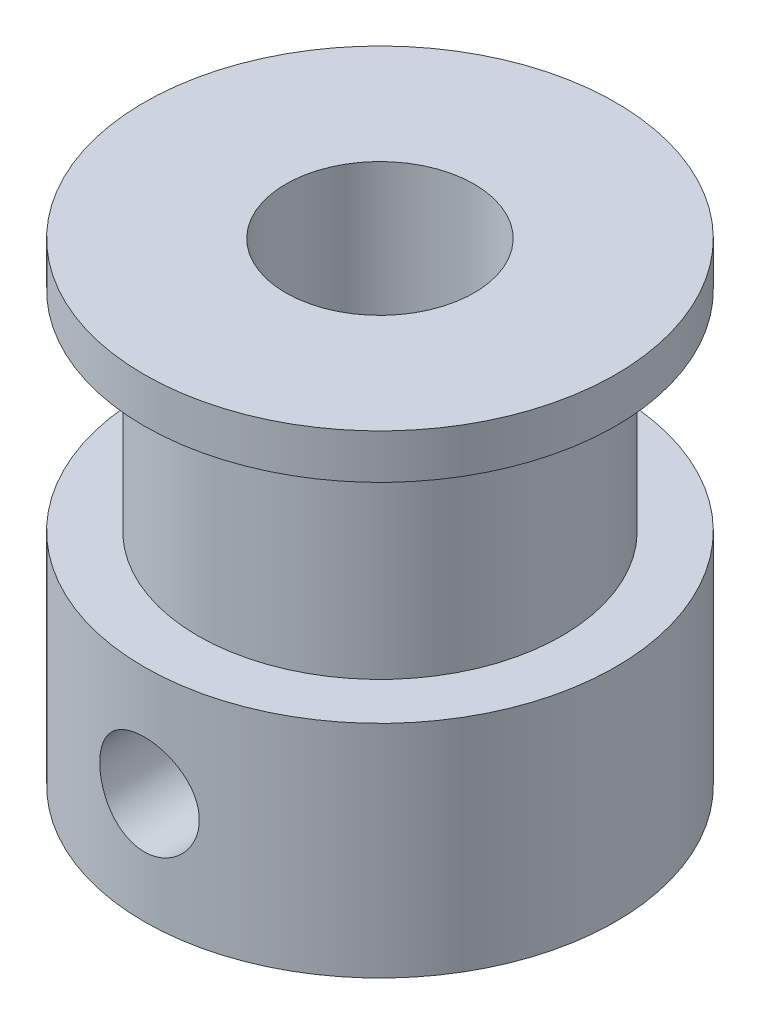
ISO-10303-21;
HEADER;
FILE_DESCRIPTION(('STEP AP214'),'2;1');
FILE_NAME('part.step','',(''),(''),'','','');
FILE_SCHEMA(('AUTOMOTIVE_DESIGN { 1 0 10303 214 1 1 1 1 }'));
ENDSEC;
DATA;
#1=APPLICATION_CONTEXT('core data for automotive mechanical design processes');
#2=APPLICATION_PROTOCOL_DEFINITION('international standard','automotive_design',2000,#1);
#3=PRODUCT_CONTEXT('',#1,'mechanical');
#4=PRODUCT('Part','Part','',(#3));
#5=PRODUCT_RELATED_PRODUCT_CATEGORY('part','',(#4));
#6=PRODUCT_DEFINITION_FORMATION('','',#4);
#7=PRODUCT_DEFINITION_CONTEXT('part definition',#1,'design');
#8=PRODUCT_DEFINITION('design','',#6,#7);
#9=PRODUCT_DEFINITION_SHAPE('','',#8);
#10=(LENGTH_UNIT() NAMED_UNIT(*) SI_UNIT(.MILLI.,.METRE.));
#11=(NAMED_UNIT(*) PLANE_ANGLE_UNIT() SI_UNIT($,.RADIAN.));
#12=(NAMED_UNIT(*) SI_UNIT($,.STERADIAN.) SOLID_ANGLE_UNIT());
#13=UNCERTAINTY_MEASURE_WITH_UNIT(LENGTH_MEASURE(1.E-05),#10,'distance_accuracy_value','');
#14=(GEOMETRIC_REPRESENTATION_CONTEXT(3) GLOBAL_UNCERTAINTY_ASSIGNED_CONTEXT((#13)) GLOBAL_UNIT_ASSIGNED_CONTEXT((#10,
#11,#12)) REPRESENTATION_CONTEXT('',''));
#15=CARTESIAN_POINT('',(0.,0.,0.));
#16=DIRECTION('',(0.,0.,1.));
#17=DIRECTION('',(1.,0.,0.));
#18=AXIS2_PLACEMENT_3D('',#15,#16,#17);
#19=CARTESIAN_POINT('',(0.,7.42,0.));
#20=DIRECTION('',(0.,1.,0.));
#21=DIRECTION('',(0.,0.,1.));
#22=AXIS2_PLACEMENT_3D('',#19,#20,#21);
#23=PLANE('',#22);
#24=CARTESIAN_POINT('',(0.,7.42,0.));
#25=DIRECTION('',(0.,1.,0.));
#26=DIRECTION('',(0.,0.,1.));
#27=AXIS2_PLACEMENT_3D('',#24,#25,#26);
#28=CIRCLE('',#27,6.12);
#29=CARTESIAN_POINT('',(0.,7.42,6.12));
#30=VERTEX_POINT('',#29);
#31=EDGE_CURVE('E11',#30,#30,#28,.T.);
#32=ORIENTED_EDGE('',*,*,#31,.F.);
#33=EDGE_LOOP('',(#32));
#34=FACE_BOUND('',#33,.T.);
#35=CARTESIAN_POINT('',(0.,7.42,0.));
#36=DIRECTION('',(0.,1.,0.));
#37=DIRECTION('',(0.,0.,1.));
#38=AXIS2_PLACEMENT_3D('',#35,#36,#37);
#39=CIRCLE('',#38,7.92999999999999);
#40=CARTESIAN_POINT('',(0.,7.42,7.92999999999999));
#41=VERTEX_POINT('',#40);
#42=EDGE_CURVE('E52',#41,#41,#39,.T.);
#43=ORIENTED_EDGE('',*,*,#42,.T.);
#44=EDGE_LOOP('',(#43));
#45=FACE_BOUND('',#44,.T.);
#46=ADVANCED_FACE('F38',(#34,#45),#23,.T.);
#47=CARTESIAN_POINT('',(0.,0.,0.));
#48=DIRECTION('',(0.,1.,0.));
#49=DIRECTION('',(0.,0.,1.));
#50=AXIS2_PLACEMENT_3D('',#47,#48,#49);
#51=PLANE('',#50);
#52=CARTESIAN_POINT('',(0.,0.,0.));
#53=DIRECTION('',(0.,1.,0.));
#54=DIRECTION('',(0.,0.,1.));
#55=AXIS2_PLACEMENT_3D('',#52,#53,#54);
#56=CIRCLE('',#55,7.92999999999999);
#57=CARTESIAN_POINT('',(0.,0.,7.92999999999999));
#58=VERTEX_POINT('',#57);
#59=EDGE_CURVE('E57',#58,#58,#56,.T.);
#60=ORIENTED_EDGE('',*,*,#59,.F.);
#61=EDGE_LOOP('',(#60));
#62=FACE_BOUND('',#61,.T.);
#63=CARTESIAN_POINT('',(0.,0.,0.));
#64=DIRECTION('',(0.,1.,0.));
#65=DIRECTION('',(0.,0.,1.));
#66=AXIS2_PLACEMENT_3D('',#63,#64,#65);
#67=CIRCLE('',#66,3.17000000000001);
#68=CARTESIAN_POINT('',(0.,0.,3.17000000000001));
#69=VERTEX_POINT('',#68);
#70=EDGE_CURVE('E63',#69,#69,#67,.T.);
#71=ORIENTED_EDGE('',*,*,#70,.T.);
#72=EDGE_LOOP('',(#71));
#73=FACE_BOUND('',#72,.T.);
#74=ADVANCED_FACE('F69',(#62,#73),#51,.F.);
#75=CARTESIAN_POINT('',(0.,7.42,0.));
#76=DIRECTION('',(0.,-1.,0.));
#77=DIRECTION('',(0.,0.,-1.));
#78=AXIS2_PLACEMENT_3D('',#75,#76,#77);
#79=CYLINDRICAL_SURFACE('',#78,7.92999999999999);
#80=CARTESIAN_POINT('',(0.,2.035,7.92999999999999));
#81=CARTESIAN_POINT('',(-0.0929785195609703,2.03500328079509,7.92999827888013));
#82=CARTESIAN_POINT('',(-0.185997419259813,2.0427679426953,7.92834806738624));
#83=CARTESIAN_POINT('',(-0.369398343951281,2.07359231272858,7.92192434589284));
#84=CARTESIAN_POINT('',(-0.45977834543358,2.09666345216657,7.91714850161958));
#85=CARTESIAN_POINT('',(-0.635223966545834,2.1573501378775,7.90500590091723));
#86=CARTESIAN_POINT('',(-0.720294848863207,2.19495100670619,7.89764175977538));
#87=CARTESIAN_POINT('',(-0.882916349447481,2.28358441702819,7.88111972055548));
#88=CARTESIAN_POINT('',(-0.960467265308537,2.33461642670223,7.87196189350387));
#89=CARTESIAN_POINT('',(-1.10701653373238,2.44947532831164,7.85270382389809));
#90=CARTESIAN_POINT('',(-1.17588571161493,2.51346520149115,7.84259255510153));
#91=CARTESIAN_POINT('',(-1.30199712959213,2.65207330506615,7.82264592476207));
#92=CARTESIAN_POINT('',(-1.35923838751393,2.72669243237554,7.81281058658656));
#93=CARTESIAN_POINT('',(-1.46103076880605,2.88538534262308,7.79442114612899));
#94=CARTESIAN_POINT('',(-1.5054459194911,2.96954813030429,7.78588119752874));
#95=CARTESIAN_POINT('',(-1.57945356651655,3.144352653784,7.77120706386982));
#96=CARTESIAN_POINT('',(-1.60904770745094,3.23499366945837,7.76507261190476));
#97=CARTESIAN_POINT('',(-1.65214944714117,3.41878505753669,7.75601604452723));
#98=CARTESIAN_POINT('',(-1.66588491558434,3.51187970429349,7.75304847322218));
#99=CARTESIAN_POINT('',(-1.67758763937562,3.69909571655325,7.75052502797822));
#100=CARTESIAN_POINT('',(-1.6755566980792,3.79321696340439,7.75096876385534));
#101=CARTESIAN_POINT('',(-1.6559679816574,3.97813151638685,7.75517658258885));
#102=CARTESIAN_POINT('',(-1.63867347277293,4.06895418537422,7.75888436438763));
#103=CARTESIAN_POINT('',(-1.58946501005289,4.24637923623298,7.76911363764519));
#104=CARTESIAN_POINT('',(-1.55755028585949,4.33298139545425,7.77563527736869));
#105=CARTESIAN_POINT('',(-1.47976165619798,4.50025483821633,7.79081377601787));
#106=CARTESIAN_POINT('',(-1.43378524385488,4.5808769788526,7.79948622303128));
#107=CARTESIAN_POINT('',(-1.32925051635568,4.73335990928457,7.81797942891874));
#108=CARTESIAN_POINT('',(-1.27069059612902,4.8052195795619,7.82780033420975));
#109=CARTESIAN_POINT('',(-1.14125099198299,4.93965486455684,7.84772642201304));
#110=CARTESIAN_POINT('',(-1.07014709713321,5.00201454147165,7.85783334805819));
#111=CARTESIAN_POINT('',(-0.918378148910625,5.11395788899735,7.87701229299846));
#112=CARTESIAN_POINT('',(-0.837712944271661,5.16354135744088,7.88608429551596));
#113=CARTESIAN_POINT('',(-0.668857349893165,5.24857260667174,7.90219762304859));
#114=CARTESIAN_POINT('',(-0.580653068089339,5.28399357797838,7.90923508979979));
#115=CARTESIAN_POINT('',(-0.399363319651179,5.33945267262922,7.92045751251892));
#116=CARTESIAN_POINT('',(-0.306278515779156,5.35949287889137,7.92464285472309));
#117=CARTESIAN_POINT('',(-0.119723690143854,5.38331093715938,7.92963496486762));
#118=CARTESIAN_POINT('',(-0.0262929491256835,5.38738398107678,7.93050305264236));
#119=CARTESIAN_POINT('',(0.159913935145314,5.37995009729393,7.92893405692231));
#120=CARTESIAN_POINT('',(0.252690119284892,5.36844415155001,7.92649718174199));
#121=CARTESIAN_POINT('',(0.433986826800555,5.33042388864374,7.91863063370873));
#122=CARTESIAN_POINT('',(0.522540975889206,5.30406301981403,7.91323157443235));
#123=CARTESIAN_POINT('',(0.693971384501054,5.23725043405823,7.90004442011031));
#124=CARTESIAN_POINT('',(0.776847182733767,5.19679757396559,7.89225613125238));
#125=CARTESIAN_POINT('',(0.935798994223132,5.10232461982279,7.87500248942195));
#126=CARTESIAN_POINT('',(1.01176853912059,5.04812933850005,7.86551598580049));
#127=CARTESIAN_POINT('',(1.15364093877458,4.92794221635097,7.84596395077763));
#128=CARTESIAN_POINT('',(1.21954257850674,4.86194895379196,7.83589834969053));
#129=CARTESIAN_POINT('',(1.34056419387628,4.71868886632637,7.81611285332782));
#130=CARTESIAN_POINT('',(1.39548045953024,4.64124850994498,7.80640181678013));
#131=CARTESIAN_POINT('',(1.49152782471683,4.47806993190348,7.78862249141513));
#132=CARTESIAN_POINT('',(1.53265950510428,4.39233206008032,7.78055413338428));
#133=CARTESIAN_POINT('',(1.59970241014937,4.2154428017032,7.76704725007528));
#134=CARTESIAN_POINT('',(1.62569681688632,4.12432409053801,7.76159438196496));
#135=CARTESIAN_POINT('',(1.66197477563768,3.93888310824507,7.7539080439279));
#136=CARTESIAN_POINT('',(1.67226064676589,3.84456131210377,7.75167409878148));
#137=CARTESIAN_POINT('',(1.67673608330772,3.65744187468164,7.75070703997789));
#138=CARTESIAN_POINT('',(1.67124816640621,3.56465216232954,7.75190377972705));
#139=CARTESIAN_POINT('',(1.64504903919186,3.38135116663489,7.7575053923616));
#140=CARTESIAN_POINT('',(1.62433798384298,3.29083986010902,7.76191023259013));
#141=CARTESIAN_POINT('',(1.56843148636623,3.1149002237667,7.77339868493138));
#142=CARTESIAN_POINT('',(1.53327995492345,3.02945737539809,7.78047417087825));
#143=CARTESIAN_POINT('',(1.44952922579225,2.86563299060743,7.79651043460839));
#144=CARTESIAN_POINT('',(1.40092873745623,2.78725213285646,7.80547139331384));
#145=CARTESIAN_POINT('',(1.29057688423831,2.63818012077453,7.82448056626243));
#146=CARTESIAN_POINT('',(1.22859439452383,2.56766223798156,7.83454612431419));
#147=CARTESIAN_POINT('',(1.09371008609985,2.43792232559419,7.85451063175016));
#148=CARTESIAN_POINT('',(1.02080575457955,2.37870290260699,7.86440954220889));
#149=CARTESIAN_POINT('',(0.86510097098892,2.27256867264387,7.88306506585043));
#150=CARTESIAN_POINT('',(0.782192912906183,2.22580895595808,7.89180665584748));
#151=CARTESIAN_POINT('',(0.609529884101386,2.14696153543418,7.90701316428416));
#152=CARTESIAN_POINT('',(0.519780912016576,2.11486114602011,7.91348005004096));
#153=CARTESIAN_POINT('',(0.358245615745182,2.07216964208584,7.92221227215797));
#154=CARTESIAN_POINT('',(0.287352762826745,2.05825689393976,7.92511499560546));
#155=CARTESIAN_POINT('',(0.144314683473388,2.0396709792332,7.92900949034278));
#156=CARTESIAN_POINT('',(0.0721695058375225,2.03499745346171,7.93000133592544));
#157=CARTESIAN_POINT('',(0.,2.035,7.92999999999999));
#158=B_SPLINE_CURVE_WITH_KNOTS('',3,(#80,#81,#82,#83,#84,#85,#86,#87,#88,#89,#90,#91,#92,#93,
#94,#95,#96,#97,#98,#99,#100,#101,#102,#103,#104,#105,#106,#107,#108,#109,#110,#111,#112,#113,
#114,#115,#116,#117,#118,#119,#120,#121,#122,#123,#124,#125,#126,#127,#128,#129,#130,#131,#132,
#133,#134,#135,#136,#137,#138,#139,#140,#141,#142,#143,#144,#145,#146,#147,#148,#149,#150,#151,
#152,#153,#154,#155,#156,#157),.UNSPECIFIED.,.T.,.F.,(4,2,2,2,2,2,2,2,2,2,2,2,2,2,2,2,2,2,2,2,2,
2,2,2,2,2,2,2,2,2,2,2,2,2,2,2,2,2,4),(0.,0.278671452541108,0.557551259334921,0.836150084481277,
1.11473787989128,1.3970756543555,1.67943726707259,1.96469074190857,2.2499125569484,
2.530982977346,2.812021249498,3.08830488061134,3.36460307113683,3.64296546861559,
3.92136339329274,4.20536389090204,4.48936888218441,4.77390897557075,5.05841052872255,
5.33762685746145,5.61682558778865,5.89319177004584,6.16958037682554,6.44968698620969,
6.72982737302403,7.01475973414001,7.29968008726688,7.58301960507788,7.8663172883,
8.14386400355453,8.42140789356096,8.69811400103385,8.97484667220265,9.25680797279111,
9.53883424471114,9.82422237244761,10.1093630669253,10.3256749965865,10.5419785161077),.UNSPECIFIED.);
#159=CARTESIAN_POINT('',(0.,2.035,7.92999999999999));
#160=VERTEX_POINT('',#159);
#161=EDGE_CURVE('E128',#160,#160,#158,.T.);
#162=ORIENTED_EDGE('',*,*,#161,.T.);
#163=EDGE_LOOP('',(#162));
#164=FACE_BOUND('',#163,.T.);
#165=CARTESIAN_POINT('',(-7.92999999999999,2.035,0.));
#166=CARTESIAN_POINT('',(-7.92999827888013,2.03500328079509,-0.092978519560998));
#167=CARTESIAN_POINT('',(-7.92834806738624,2.0427679426953,-0.185997419259841));
#168=CARTESIAN_POINT('',(-7.92192434589284,2.07359231272858,-0.369398343951309));
#169=CARTESIAN_POINT('',(-7.91714850161958,2.09666345216657,-0.459778345433608));
#170=CARTESIAN_POINT('',(-7.90500590091722,2.1573501378775,-0.635223966545862));
#171=CARTESIAN_POINT('',(-7.89764175977538,2.19495100670619,-0.720294848863235));
#172=CARTESIAN_POINT('',(-7.88111972055548,2.2835844170282,-0.882916349447509));
#173=CARTESIAN_POINT('',(-7.87196189350386,2.33461642670223,-0.960467265308565));
#174=CARTESIAN_POINT('',(-7.85270382389809,2.44947532831164,-1.10701653373241));
#175=CARTESIAN_POINT('',(-7.84259255510153,2.51346520149115,-1.17588571161496));
#176=CARTESIAN_POINT('',(-7.82264592476206,2.65207330506615,-1.30199712959216));
#177=CARTESIAN_POINT('',(-7.81281058658656,2.72669243237554,-1.35923838751396));
#178=CARTESIAN_POINT('',(-7.79442114612899,2.88538534262308,-1.46103076880608));
#179=CARTESIAN_POINT('',(-7.78588119752874,2.96954813030429,-1.50544591949112));
#180=CARTESIAN_POINT('',(-7.77120706386981,3.144352653784,-1.57945356651658));
#181=CARTESIAN_POINT('',(-7.76507261190475,3.23499366945837,-1.60904770745097));
#182=CARTESIAN_POINT('',(-7.75601604452723,3.41878505753669,-1.6521494471412));
#183=CARTESIAN_POINT('',(-7.75304847322218,3.51187970429349,-1.66588491558437));
#184=CARTESIAN_POINT('',(-7.75052502797821,3.69909571655325,-1.67758763937565));
#185=CARTESIAN_POINT('',(-7.75096876385533,3.79321696340439,-1.67555669807923));
#186=CARTESIAN_POINT('',(-7.75517658258885,3.97813151638685,-1.65596798165742));
#187=CARTESIAN_POINT('',(-7.75888436438762,4.06895418537422,-1.63867347277296));
#188=CARTESIAN_POINT('',(-7.76911363764518,4.24637923623298,-1.58946501005292));
#189=CARTESIAN_POINT('',(-7.77563527736868,4.33298139545425,-1.55755028585952));
#190=CARTESIAN_POINT('',(-7.79081377601786,4.50025483821633,-1.479761656198));
#191=CARTESIAN_POINT('',(-7.79948622303128,4.5808769788526,-1.43378524385491));
#192=CARTESIAN_POINT('',(-7.81797942891874,4.73335990928457,-1.32925051635571));
#193=CARTESIAN_POINT('',(-7.82780033420975,4.8052195795619,-1.27069059612905));
#194=CARTESIAN_POINT('',(-7.84772642201304,4.93965486455684,-1.14125099198301));
#195=CARTESIAN_POINT('',(-7.85783334805818,5.00201454147165,-1.07014709713323));
#196=CARTESIAN_POINT('',(-7.87701229299845,5.11395788899735,-0.918378148910653));
#197=CARTESIAN_POINT('',(-7.88608429551596,5.16354135744088,-0.837712944271688));
#198=CARTESIAN_POINT('',(-7.90219762304858,5.24857260667174,-0.668857349893192));
#199=CARTESIAN_POINT('',(-7.90923508979978,5.28399357797838,-0.580653068089367));
#200=CARTESIAN_POINT('',(-7.92045751251892,5.33945267262922,-0.399363319651207));
#201=CARTESIAN_POINT('',(-7.92464285472309,5.35949287889137,-0.306278515779184));
#202=CARTESIAN_POINT('',(-7.92963496486762,5.38331093715938,-0.119723690143881));
#203=CARTESIAN_POINT('',(-7.93050305264236,5.38738398107678,-0.0262929491257112));
#204=CARTESIAN_POINT('',(-7.92893405692231,5.37995009729393,0.159913935145286));
#205=CARTESIAN_POINT('',(-7.92649718174199,5.36844415155001,0.252690119284864));
#206=CARTESIAN_POINT('',(-7.91863063370873,5.33042388864374,0.433986826800527));
#207=CARTESIAN_POINT('',(-7.91323157443235,5.30406301981403,0.522540975889178));
#208=CARTESIAN_POINT('',(-7.90004442011032,5.23725043405823,0.693971384501026));
#209=CARTESIAN_POINT('',(-7.89225613125238,5.19679757396559,0.77684718273374));
#210=CARTESIAN_POINT('',(-7.87500248942195,5.10232461982279,0.935798994223104));
#211=CARTESIAN_POINT('',(-7.86551598580049,5.04812933850005,1.01176853912056));
#212=CARTESIAN_POINT('',(-7.84596395077764,4.92794221635097,1.15364093877455));
#213=CARTESIAN_POINT('',(-7.83589834969053,4.86194895379196,1.21954257850671));
#214=CARTESIAN_POINT('',(-7.81611285332783,4.71868886632637,1.34056419387625));
#215=CARTESIAN_POINT('',(-7.80640181678013,4.64124850994498,1.39548045953021));
#216=CARTESIAN_POINT('',(-7.78862249141514,4.47806993190348,1.4915278247168));
#217=CARTESIAN_POINT('',(-7.78055413338428,4.39233206008032,1.53265950510425));
#218=CARTESIAN_POINT('',(-7.76704725007529,4.2154428017032,1.59970241014934));
#219=CARTESIAN_POINT('',(-7.76159438196497,4.12432409053801,1.62569681688629));
#220=CARTESIAN_POINT('',(-7.75390804392791,3.93888310824507,1.66197477563765));
#221=CARTESIAN_POINT('',(-7.75167409878149,3.84456131210377,1.67226064676586));
#222=CARTESIAN_POINT('',(-7.7507070399779,3.65744187468164,1.6767360833077));
#223=CARTESIAN_POINT('',(-7.75190377972705,3.56465216232954,1.67124816640618));
#224=CARTESIAN_POINT('',(-7.75750539236161,3.38135116663489,1.64504903919183));
#225=CARTESIAN_POINT('',(-7.76191023259014,3.29083986010902,1.62433798384295));
#226=CARTESIAN_POINT('',(-7.77339868493138,3.1149002237667,1.5684314863662));
#227=CARTESIAN_POINT('',(-7.78047417087826,3.02945737539809,1.53327995492342));
#228=CARTESIAN_POINT('',(-7.79651043460839,2.86563299060743,1.44952922579223));
#229=CARTESIAN_POINT('',(-7.80547139331384,2.78725213285646,1.40092873745621));
#230=CARTESIAN_POINT('',(-7.82448056626244,2.63818012077453,1.29057688423828));
#231=CARTESIAN_POINT('',(-7.8345461243142,2.56766223798156,1.22859439452381));
#232=CARTESIAN_POINT('',(-7.85451063175016,2.43792232559419,1.09371008609982));
#233=CARTESIAN_POINT('',(-7.86440954220889,2.37870290260699,1.02080575457952));
#234=CARTESIAN_POINT('',(-7.88306506585043,2.27256867264387,0.865100970988893));
#235=CARTESIAN_POINT('',(-7.89180665584748,2.22580895595808,0.782192912906156));
#236=CARTESIAN_POINT('',(-7.90701316428416,2.14696153543418,0.609529884101358));
#237=CARTESIAN_POINT('',(-7.91348005004096,2.11486114602011,0.519780912016548));
#238=CARTESIAN_POINT('',(-7.92221227215798,2.07216964208584,0.358245615745155));
#239=CARTESIAN_POINT('',(-7.92511499560546,2.05825689393976,0.287352762826718));
#240=CARTESIAN_POINT('',(-7.92900949034278,2.0396709792332,0.144314683473361));
#241=CARTESIAN_POINT('',(-7.93000133592544,2.03499745346171,0.0721695058374948));
#242=CARTESIAN_POINT('',(-7.92999999999999,2.035,0.));
#243=B_SPLINE_CURVE_WITH_KNOTS('',3,(#165,#166,#167,#168,#169,#170,#171,#172,#173,#174,#175,
#176,#177,#178,#179,#180,#181,#182,#183,#184,#185,#186,#187,#188,#189,#190,#191,#192,#193,#194,
#195,#196,#197,#198,#199,#200,#201,#202,#203,#204,#205,#206,#207,#208,#209,#210,#211,#212,#213,
#214,#215,#216,#217,#218,#219,#220,#221,#222,#223,#224,#225,#226,#227,#228,#229,#230,#231,#232,
#233,#234,#235,#236,#237,#238,#239,#240,#241,#242),.UNSPECIFIED.,.T.,.F.,(4,2,2,2,2,2,2,2,2,2,2,
2,2,2,2,2,2,2,2,2,2,2,2,2,2,2,2,2,2,2,2,2,2,2,2,2,2,2,4),(0.,0.278671452541108,
0.557551259334921,0.836150084481277,1.11473787989128,1.3970756543555,1.67943726707259,
1.96469074190857,2.2499125569484,2.530982977346,2.812021249498,3.08830488061134,
3.36460307113683,3.64296546861559,3.92136339329274,4.20536389090204,4.48936888218441,
4.77390897557075,5.05841052872255,5.33762685746145,5.61682558778865,5.89319177004584,
6.16958037682554,6.44968698620969,6.72982737302403,7.01475973414001,7.29968008726688,
7.58301960507789,7.8663172883,8.14386400355453,8.42140789356096,8.69811400103385,
8.97484667220266,9.25680797279111,9.53883424471114,9.82422237244761,10.1093630669253,
10.3256749965865,10.5419785161076),.UNSPECIFIED.);
#244=CARTESIAN_POINT('',(-7.92999999999999,2.035,0.));
#245=VERTEX_POINT('',#244);
#246=EDGE_CURVE('E84',#245,#245,#243,.T.);
#247=ORIENTED_EDGE('',*,*,#246,.T.);
#248=EDGE_LOOP('',(#247));
#249=FACE_BOUND('',#248,.T.);
#250=ORIENTED_EDGE('',*,*,#42,.F.);
#251=EDGE_LOOP('',(#250));
#252=FACE_BOUND('',#251,.T.);
#253=ORIENTED_EDGE('',*,*,#59,.T.);
#254=EDGE_LOOP('',(#253));
#255=FACE_BOUND('',#254,.T.);
#256=ADVANCED_FACE('F40',(#164,#249,#252,#255),#79,.T.);
#257=CARTESIAN_POINT('',(0.,7.42,0.));
#258=DIRECTION('',(0.,-1.,0.));
#259=DIRECTION('',(0.,0.,-1.));
#260=AXIS2_PLACEMENT_3D('',#257,#258,#259);
#261=CYLINDRICAL_SURFACE('',#260,3.17000000000001);
#262=CARTESIAN_POINT('',(-1.67499999999999,3.71,2.69133331269095));
#263=CARTESIAN_POINT('',(-1.67499346283353,3.79648439824921,2.69134200203616));
#264=CARTESIAN_POINT('',(-1.66825612173463,3.88305974782359,2.69556686631455));
#265=CARTESIAN_POINT('',(-1.64168014161819,4.05348844619038,2.71182824317103));
#266=CARTESIAN_POINT('',(-1.62181712399362,4.13733642474577,2.72387929077186));
#267=CARTESIAN_POINT('',(-1.57012824194943,4.29951409897449,2.75399300770943));
#268=CARTESIAN_POINT('',(-1.53837195106729,4.37787280126857,2.77202064597558));
#269=CARTESIAN_POINT('',(-1.46401153565139,4.52812632430136,2.81200061090018));
#270=CARTESIAN_POINT('',(-1.42140581445473,4.60002019152974,2.833953515081));
#271=CARTESIAN_POINT('',(-1.32193090165022,4.74265057419274,2.88179023744682));
#272=CARTESIAN_POINT('',(-1.26410536931683,4.81266145097518,2.90784979840052));
#273=CARTESIAN_POINT('',(-1.13781341723855,4.94256576441562,2.95955049032267));
#274=CARTESIAN_POINT('',(-1.06934116651079,5.00245361917099,2.98519138344123));
#275=CARTESIAN_POINT('',(-0.917229974816401,5.11496805855883,3.03553691881878));
#276=CARTESIAN_POINT('',(-0.83282702795685,5.16667274213293,3.06001515891021));
#277=CARTESIAN_POINT('',(-0.654983284813109,5.25481363971353,3.10294034204451));
#278=CARTESIAN_POINT('',(-0.561548905231927,5.29126059738512,3.12139152699522));
#279=CARTESIAN_POINT('',(-0.376006855297978,5.34487848566569,3.14890725730692));
#280=CARTESIAN_POINT('',(-0.284363413317418,5.36333044046642,3.15859133832855));
#281=CARTESIAN_POINT('',(-0.0988124604900655,5.38468342226818,3.16981891062706));
#282=CARTESIAN_POINT('',(-0.0049065528649873,5.38759515362585,3.17136800540192));
#283=CARTESIAN_POINT('',(0.172745296010614,5.37820961467272,3.16641613798777));
#284=CARTESIAN_POINT('',(0.256594402305525,5.36735801991455,3.16068029107479));
#285=CARTESIAN_POINT('',(0.421074840969534,5.3333834202132,3.14299834900193));
#286=CARTESIAN_POINT('',(0.501705929005442,5.31025948537156,3.13105178324551));
#287=CARTESIAN_POINT('',(0.658753088260629,5.25232480940437,3.1018396810518));
#288=CARTESIAN_POINT('',(0.735105014468344,5.21737363674362,3.08451044630368));
#289=CARTESIAN_POINT('',(0.881026802894886,5.13701181063053,3.04604564224671));
#290=CARTESIAN_POINT('',(0.950594349942383,5.09159760431816,3.02490878054123));
#291=CARTESIAN_POINT('',(1.08857410967112,4.98628941263979,2.97821056653827));
#292=CARTESIAN_POINT('',(1.15614066664665,4.92538961419821,2.95241779603318));
#293=CARTESIAN_POINT('',(1.2805843724806,4.79349513716763,2.90061313752874));
#294=CARTESIAN_POINT('',(1.33745164505913,4.72249123683348,2.87460107001307));
#295=CARTESIAN_POINT('',(1.44320889604926,4.56579011420326,2.82307792653257));
#296=CARTESIAN_POINT('',(1.49115080043295,4.47938324259583,2.79775875240879));
#297=CARTESIAN_POINT('',(1.57147301543317,4.29812750054586,2.75345150482061));
#298=CARTESIAN_POINT('',(1.6038708182821,4.20328826248387,2.73445632218979));
#299=CARTESIAN_POINT('',(1.64942452705996,4.01585928874452,2.70720449408423));
#300=CARTESIAN_POINT('',(1.66392722324273,3.92371029492007,2.69820223917527));
#301=CARTESIAN_POINT('',(1.67734984935964,3.73788349459839,2.68988345980943));
#302=CARTESIAN_POINT('',(1.67628417988621,3.64420718098236,2.69055798441174));
#303=CARTESIAN_POINT('',(1.65983573518431,3.47092853025249,2.70072311664916));
#304=CARTESIAN_POINT('',(1.64631737378123,3.39106936095373,2.7090653644306));
#305=CARTESIAN_POINT('',(1.60823091058481,3.23494356939082,2.73184590721295));
#306=CARTESIAN_POINT('',(1.58365860977592,3.15867832450999,2.74628651864699));
#307=CARTESIAN_POINT('',(1.52304956159557,3.0079751686933,2.78037304765879));
#308=CARTESIAN_POINT('',(1.48654886719336,2.93377186953392,2.80022303539684));
#309=CARTESIAN_POINT('',(1.40350959634971,2.79210237226663,2.8427515416354));
#310=CARTESIAN_POINT('',(1.35696588728006,2.7246396449147,2.86543150392665));
#311=CARTESIAN_POINT('',(1.24735566240581,2.58819480035188,2.91498134615006));
#312=CARTESIAN_POINT('',(1.18287521306221,2.52039153457985,2.94198444767649));
#313=CARTESIAN_POINT('',(1.04314071881182,2.39614025653172,2.99438254564296));
#314=CARTESIAN_POINT('',(0.967881629120343,2.33969759134042,3.01977678100415));
#315=CARTESIAN_POINT('',(0.804860664606493,2.23778633293795,3.06734031223637));
#316=CARTESIAN_POINT('',(0.716725151838387,2.19283273459949,3.08934481917904));
#317=CARTESIAN_POINT('',(0.532647057877203,2.11886079287854,3.12633447944415));
#318=CARTESIAN_POINT('',(0.436712180845658,2.08982693850201,3.14132646313803));
#319=CARTESIAN_POINT('',(0.249886673915743,2.05127424210683,3.16139308939411));
#320=CARTESIAN_POINT('',(0.159421753593299,2.04012309016066,3.16729498192799));
#321=CARTESIAN_POINT('',(-0.0222732655933649,2.03268550489231,3.17122143002979));
#322=CARTESIAN_POINT('',(-0.113503008697829,2.03639250570058,3.16924946508428));
#323=CARTESIAN_POINT('',(-0.286526463816091,2.05756997290504,3.15812154966277));
#324=CARTESIAN_POINT('',(-0.368497422442829,2.07393336235222,3.14954367953487));
#325=CARTESIAN_POINT('',(-0.528358901444032,2.11835092291835,3.12670111615674));
#326=CARTESIAN_POINT('',(-0.606248894391589,2.14640660098199,3.11243568988385));
#327=CARTESIAN_POINT('',(-0.759157904697322,2.21448002607678,3.07878982940603));
#328=CARTESIAN_POINT('',(-0.833949822542044,2.25491795723241,3.05923310833934));
#329=CARTESIAN_POINT('',(-0.975965191019274,2.34609150529192,3.01693407608346));
#330=CARTESIAN_POINT('',(-1.04318531092448,2.39683162669333,2.99419037278059));
#331=CARTESIAN_POINT('',(-1.17589308315796,2.51353206077645,2.94477788431154));
#332=CARTESIAN_POINT('',(-1.24039575351798,2.5805478950442,2.91795132603337));
#333=CARTESIAN_POINT('',(-1.35767764806856,2.72462005253595,2.865267035651));
#334=CARTESIAN_POINT('',(-1.41044432222435,2.80168698569638,2.83941036503048));
#335=CARTESIAN_POINT('',(-1.50519417833689,2.96859349669884,2.79039063217971));
#336=CARTESIAN_POINT('',(-1.54649995745089,3.05888101589493,2.76742896808057));
#337=CARTESIAN_POINT('',(-1.6127022091814,3.24669443108084,2.72939206238022));
#338=CARTESIAN_POINT('',(-1.63765264044974,3.34419533202674,2.71429092208461));
#339=CARTESIAN_POINT('',(-1.66074792829189,3.48744059709172,2.70016155719206));
#340=CARTESIAN_POINT('',(-1.66608167884508,3.53170955250747,2.69686656000831));
#341=CARTESIAN_POINT('',(-1.67320948883538,3.62064423065221,2.69245014041561));
#342=CARTESIAN_POINT('',(-1.67500337802141,3.66530997236103,2.6913288225507));
#343=CARTESIAN_POINT('',(-1.67499999999999,3.71,2.69133331269095));
#344=B_SPLINE_CURVE_WITH_KNOTS('',3,(#262,#263,#264,#265,#266,#267,#268,#269,#270,#271,#272,
#273,#274,#275,#276,#277,#278,#279,#280,#281,#282,#283,#284,#285,#286,#287,#288,#289,#290,#291,
#292,#293,#294,#295,#296,#297,#298,#299,#300,#301,#302,#303,#304,#305,#306,#307,#308,#309,#310,
#311,#312,#313,#314,#315,#316,#317,#318,#319,#320,#321,#322,#323,#324,#325,#326,#327,#328,#329,
#330,#331,#332,#333,#334,#335,#336,#337,#338,#339,#340,#341,#342,#343),.UNSPECIFIED.,.T.,.F.,(4,
2,2,2,2,2,2,2,2,2,2,2,2,2,2,2,2,2,2,2,2,2,2,2,2,2,2,2,2,2,2,2,2,2,2,2,2,2,2,2,4),(0.,
0.259264400117591,0.519011696257393,0.777262666180211,1.03555166374795,1.31779380756931,
1.60019107748804,1.90446476684829,2.20852384128486,2.48888336782233,2.76904975324711,
3.02208210926877,3.27513364076935,3.53130185409757,3.7875571812348,4.07001777595003,
4.35273783831911,4.65717081863311,4.96126040336887,5.24070224491567,5.51988562175513,
5.76305867886211,6.00632418724563,6.2604789940826,6.51476399936711,6.80564810091937,
7.09666879414358,7.3990611816612,7.70115841499529,7.97367896217564,8.2460790948555,
8.49702363818264,8.74800053416261,9.00867154634373,9.26945677990101,9.55862780434918,
9.84810658636562,10.1521729244118,10.4552309863223,10.5891970683315,10.7231695933374),.UNSPECIFIED.);
#345=CARTESIAN_POINT('',(-1.67499999999999,3.71,2.69133331269095));
#346=VERTEX_POINT('',#345);
#347=EDGE_CURVE('E214',#346,#346,#344,.T.);
#348=ORIENTED_EDGE('',*,*,#347,.F.);
#349=EDGE_LOOP('',(#348));
#350=FACE_BOUND('',#349,.T.);
#351=CARTESIAN_POINT('',(-2.69133331269095,3.71,-1.675));
#352=CARTESIAN_POINT('',(-2.69134200203616,3.79648439824921,-1.67499346283354));
#353=CARTESIAN_POINT('',(-2.69556686631454,3.88305974782359,-1.66825612173464));
#354=CARTESIAN_POINT('',(-2.71182824317103,4.05348844619038,-1.6416801416182));
#355=CARTESIAN_POINT('',(-2.72387929077185,4.13733642474577,-1.62181712399363));
#356=CARTESIAN_POINT('',(-2.75399300770942,4.29951409897449,-1.57012824194944));
#357=CARTESIAN_POINT('',(-2.77202064597557,4.37787280126857,-1.5383719510673));
#358=CARTESIAN_POINT('',(-2.81200061090018,4.52812632430136,-1.4640115356514));
#359=CARTESIAN_POINT('',(-2.833953515081,4.60002019152974,-1.42140581445474));
#360=CARTESIAN_POINT('',(-2.88179023744681,4.74265057419274,-1.32193090165023));
#361=CARTESIAN_POINT('',(-2.90784979840052,4.81266145097518,-1.26410536931684));
#362=CARTESIAN_POINT('',(-2.95955049032267,4.94256576441562,-1.13781341723856));
#363=CARTESIAN_POINT('',(-2.98519138344123,5.00245361917099,-1.0693411665108));
#364=CARTESIAN_POINT('',(-3.03553691881877,5.11496805855883,-0.917229974816411));
#365=CARTESIAN_POINT('',(-3.0600151589102,5.16667274213293,-0.832827027956861));
#366=CARTESIAN_POINT('',(-3.1029403420445,5.25481363971353,-0.65498328481312));
#367=CARTESIAN_POINT('',(-3.12139152699522,5.29126059738512,-0.561548905231938));
#368=CARTESIAN_POINT('',(-3.14890725730692,5.34487848566569,-0.376006855297989));
#369=CARTESIAN_POINT('',(-3.15859133832854,5.36333044046642,-0.284363413317429));
#370=CARTESIAN_POINT('',(-3.16981891062706,5.38468342226818,-0.0988124604900766));
#371=CARTESIAN_POINT('',(-3.17136800540192,5.38759515362585,-0.00490655286499838));
#372=CARTESIAN_POINT('',(-3.16641613798777,5.37820961467272,0.172745296010603));
#373=CARTESIAN_POINT('',(-3.16068029107479,5.36735801991455,0.256594402305514));
#374=CARTESIAN_POINT('',(-3.14299834900193,5.3333834202132,0.421074840969523));
#375=CARTESIAN_POINT('',(-3.13105178324552,5.31025948537156,0.501705929005431));
#376=CARTESIAN_POINT('',(-3.1018396810518,5.25232480940437,0.658753088260618));
#377=CARTESIAN_POINT('',(-3.08451044630369,5.21737363674362,0.735105014468333));
#378=CARTESIAN_POINT('',(-3.04604564224671,5.13701181063053,0.881026802894875));
#379=CARTESIAN_POINT('',(-3.02490878054123,5.09159760431816,0.950594349942372));
#380=CARTESIAN_POINT('',(-2.97821056653828,4.98628941263979,1.08857410967111));
#381=CARTESIAN_POINT('',(-2.95241779603318,4.92538961419821,1.15614066664664));
#382=CARTESIAN_POINT('',(-2.90061313752875,4.79349513716763,1.28058437248059));
#383=CARTESIAN_POINT('',(-2.87460107001308,4.72249123683348,1.33745164505912));
#384=CARTESIAN_POINT('',(-2.82307792653258,4.56579011420326,1.44320889604925));
#385=CARTESIAN_POINT('',(-2.79775875240879,4.47938324259583,1.49115080043294));
#386=CARTESIAN_POINT('',(-2.75345150482061,4.29812750054586,1.57147301543316));
#387=CARTESIAN_POINT('',(-2.73445632218979,4.20328826248387,1.60387081828209));
#388=CARTESIAN_POINT('',(-2.70720449408424,4.01585928874452,1.64942452705995));
#389=CARTESIAN_POINT('',(-2.69820223917527,3.92371029492007,1.66392722324272));
#390=CARTESIAN_POINT('',(-2.68988345980944,3.73788349459839,1.67734984935963));
#391=CARTESIAN_POINT('',(-2.69055798441175,3.64420718098236,1.6762841798862));
#392=CARTESIAN_POINT('',(-2.70072311664917,3.47092853025249,1.6598357351843));
#393=CARTESIAN_POINT('',(-2.70906536443061,3.39106936095373,1.64631737378122));
#394=CARTESIAN_POINT('',(-2.73184590721295,3.23494356939082,1.6082309105848));
#395=CARTESIAN_POINT('',(-2.74628651864699,3.15867832450999,1.58365860977591));
#396=CARTESIAN_POINT('',(-2.78037304765879,3.0079751686933,1.52304956159556));
#397=CARTESIAN_POINT('',(-2.80022303539684,2.93377186953392,1.48654886719335));
#398=CARTESIAN_POINT('',(-2.8427515416354,2.79210237226663,1.4035095963497));
#399=CARTESIAN_POINT('',(-2.86543150392666,2.7246396449147,1.35696588728005));
#400=CARTESIAN_POINT('',(-2.91498134615006,2.58819480035188,1.2473556624058));
#401=CARTESIAN_POINT('',(-2.94198444767649,2.52039153457985,1.1828752130622));
#402=CARTESIAN_POINT('',(-2.99438254564297,2.39614025653172,1.04314071881181));
#403=CARTESIAN_POINT('',(-3.01977678100415,2.33969759134042,0.967881629120332));
#404=CARTESIAN_POINT('',(-3.06734031223637,2.23778633293795,0.804860664606483));
#405=CARTESIAN_POINT('',(-3.08934481917904,2.19283273459949,0.716725151838376));
#406=CARTESIAN_POINT('',(-3.12633447944416,2.11886079287854,0.532647057877192));
#407=CARTESIAN_POINT('',(-3.14132646313803,2.08982693850201,0.436712180845647));
#408=CARTESIAN_POINT('',(-3.16139308939411,2.05127424210683,0.249886673915732));
#409=CARTESIAN_POINT('',(-3.16729498192799,2.04012309016066,0.159421753593288));
#410=CARTESIAN_POINT('',(-3.17122143002979,2.03268550489231,-0.0222732655933754));
#411=CARTESIAN_POINT('',(-3.16924946508428,2.03639250570058,-0.11350300869784));
#412=CARTESIAN_POINT('',(-3.15812154966277,2.05756997290504,-0.286526463816102));
#413=CARTESIAN_POINT('',(-3.14954367953487,2.07393336235222,-0.368497422442839));
#414=CARTESIAN_POINT('',(-3.12670111615674,2.11835092291835,-0.528358901444041));
#415=CARTESIAN_POINT('',(-3.11243568988385,2.14640660098199,-0.606248894391599));
#416=CARTESIAN_POINT('',(-3.07878982940603,2.21448002607678,-0.759157904697334));
#417=CARTESIAN_POINT('',(-3.05923310833934,2.25491795723241,-0.833949822542056));
#418=CARTESIAN_POINT('',(-3.01693407608345,2.34609150529192,-0.975965191019285));
#419=CARTESIAN_POINT('',(-2.99419037278059,2.39683162669333,-1.04318531092449));
#420=CARTESIAN_POINT('',(-2.94477788431154,2.51353206077645,-1.17589308315797));
#421=CARTESIAN_POINT('',(-2.91795132603337,2.5805478950442,-1.24039575351799));
#422=CARTESIAN_POINT('',(-2.86526703565099,2.72462005253595,-1.35767764806857));
#423=CARTESIAN_POINT('',(-2.83941036503047,2.80168698569638,-1.41044432222436));
#424=CARTESIAN_POINT('',(-2.7903906321797,2.96859349669884,-1.5051941783369));
#425=CARTESIAN_POINT('',(-2.76742896808056,3.05888101589493,-1.5464999574509));
#426=CARTESIAN_POINT('',(-2.72939206238022,3.24669443108084,-1.61270220918141));
#427=CARTESIAN_POINT('',(-2.7142909220846,3.34419533202674,-1.63765264044975));
#428=CARTESIAN_POINT('',(-2.70016155719206,3.48744059709172,-1.6607479282919));
#429=CARTESIAN_POINT('',(-2.6968665600083,3.53170955250747,-1.66608167884509));
#430=CARTESIAN_POINT('',(-2.6924501404156,3.62064423065221,-1.67320948883539));
#431=CARTESIAN_POINT('',(-2.6913288225507,3.66530997236103,-1.67500337802142));
#432=CARTESIAN_POINT('',(-2.69133331269095,3.71,-1.675));
#433=B_SPLINE_CURVE_WITH_KNOTS('',3,(#351,#352,#353,#354,#355,#356,#357,#358,#359,#360,#361,
#362,#363,#364,#365,#366,#367,#368,#369,#370,#371,#372,#373,#374,#375,#376,#377,#378,#379,#380,
#381,#382,#383,#384,#385,#386,#387,#388,#389,#390,#391,#392,#393,#394,#395,#396,#397,#398,#399,
#400,#401,#402,#403,#404,#405,#406,#407,#408,#409,#410,#411,#412,#413,#414,#415,#416,#417,#418,
#419,#420,#421,#422,#423,#424,#425,#426,#427,#428,#429,#430,#431,#432),.UNSPECIFIED.,.T.,.F.,(4,
2,2,2,2,2,2,2,2,2,2,2,2,2,2,2,2,2,2,2,2,2,2,2,2,2,2,2,2,2,2,2,2,2,2,2,2,2,2,2,4),(0.,
0.259264400117591,0.519011696257393,0.777262666180211,1.03555166374795,1.31779380756931,
1.60019107748804,1.90446476684829,2.20852384128486,2.48888336782233,2.76904975324711,
3.02208210926877,3.27513364076935,3.53130185409757,3.7875571812348,4.07001777595003,
4.35273783831911,4.65717081863311,4.96126040336887,5.24070224491567,5.51988562175513,
5.76305867886211,6.00632418724563,6.2604789940826,6.5147639993671,6.80564810091936,
7.09666879414358,7.3990611816612,7.70115841499529,7.97367896217564,8.2460790948555,
8.49702363818264,8.74800053416261,9.00867154634373,9.26945677990101,9.55862780434918,
9.84810658636562,10.1521729244118,10.4552309863223,10.5891970683315,10.7231695933374),.UNSPECIFIED.);
#434=CARTESIAN_POINT('',(-2.69133331269095,3.71,-1.675));
#435=VERTEX_POINT('',#434);
#436=EDGE_CURVE('E43',#435,#435,#433,.T.);
#437=ORIENTED_EDGE('',*,*,#436,.F.);
#438=EDGE_LOOP('',(#437));
#439=FACE_BOUND('',#438,.T.);
#440=ORIENTED_EDGE('',*,*,#70,.F.);
#441=EDGE_LOOP('',(#440));
#442=FACE_BOUND('',#441,.T.);
#443=CARTESIAN_POINT('',(0.,15.94,0.));
#444=DIRECTION('',(0.,1.,0.));
#445=DIRECTION('',(0.,0.,1.));
#446=AXIS2_PLACEMENT_3D('',#443,#444,#445);
#447=CIRCLE('',#446,3.17000000000001);
#448=CARTESIAN_POINT('',(0.,15.94,3.17000000000001));
#449=VERTEX_POINT('',#448);
#450=EDGE_CURVE('E81',#449,#449,#447,.T.);
#451=ORIENTED_EDGE('',*,*,#450,.T.);
#452=EDGE_LOOP('',(#451));
#453=FACE_BOUND('',#452,.T.);
#454=ADVANCED_FACE('F74',(#350,#439,#442,#453),#261,.F.);
#455=CARTESIAN_POINT('',(0.,14.44,0.));
#456=DIRECTION('',(0.,-1.,0.));
#457=DIRECTION('',(0.,0.,-1.));
#458=AXIS2_PLACEMENT_3D('',#455,#456,#457);
#459=CYLINDRICAL_SURFACE('',#458,6.12);
#460=CARTESIAN_POINT('',(0.,14.44,0.));
#461=DIRECTION('',(0.,1.,0.));
#462=DIRECTION('',(0.,0.,1.));
#463=AXIS2_PLACEMENT_3D('',#460,#461,#462);
#464=CIRCLE('',#463,6.12);
#465=CARTESIAN_POINT('',(0.,14.44,6.12));
#466=VERTEX_POINT('',#465);
#467=EDGE_CURVE('E61',#466,#466,#464,.T.);
#468=ORIENTED_EDGE('',*,*,#467,.F.);
#469=EDGE_LOOP('',(#468));
#470=FACE_BOUND('',#469,.T.);
#471=ORIENTED_EDGE('',*,*,#31,.T.);
#472=EDGE_LOOP('',(#471));
#473=FACE_BOUND('',#472,.T.);
#474=ADVANCED_FACE('F77',(#470,#473),#459,.T.);
#475=CARTESIAN_POINT('',(0.,15.94,0.));
#476=DIRECTION('',(0.,1.,0.));
#477=DIRECTION('',(0.,0.,1.));
#478=AXIS2_PLACEMENT_3D('',#475,#476,#477);
#479=PLANE('',#478);
#480=CARTESIAN_POINT('',(0.,15.94,0.));
#481=DIRECTION('',(0.,1.,0.));
#482=DIRECTION('',(0.,0.,1.));
#483=AXIS2_PLACEMENT_3D('',#480,#481,#482);
#484=CIRCLE('',#483,7.92999999999999);
#485=CARTESIAN_POINT('',(0.,15.94,7.92999999999999));
#486=VERTEX_POINT('',#485);
#487=EDGE_CURVE('E87',#486,#486,#484,.T.);
#488=ORIENTED_EDGE('',*,*,#487,.T.);
#489=EDGE_LOOP('',(#488));
#490=FACE_BOUND('',#489,.T.);
#491=ORIENTED_EDGE('',*,*,#450,.F.);
#492=EDGE_LOOP('',(#491));
#493=FACE_BOUND('',#492,.T.);
#494=ADVANCED_FACE('F105',(#490,#493),#479,.T.);
#495=CARTESIAN_POINT('',(0.,14.44,0.));
#496=DIRECTION('',(0.,1.,0.));
#497=DIRECTION('',(0.,0.,1.));
#498=AXIS2_PLACEMENT_3D('',#495,#496,#497);
#499=PLANE('',#498);
#500=ORIENTED_EDGE('',*,*,#467,.T.);
#501=EDGE_LOOP('',(#500));
#502=FACE_BOUND('',#501,.T.);
#503=CARTESIAN_POINT('',(0.,14.44,0.));
#504=DIRECTION('',(0.,1.,0.));
#505=DIRECTION('',(0.,0.,1.));
#506=AXIS2_PLACEMENT_3D('',#503,#504,#505);
#507=CIRCLE('',#506,7.92999999999999);
#508=CARTESIAN_POINT('',(0.,14.44,7.92999999999999));
#509=VERTEX_POINT('',#508);
#510=EDGE_CURVE('E83',#509,#509,#507,.T.);
#511=ORIENTED_EDGE('',*,*,#510,.F.);
#512=EDGE_LOOP('',(#511));
#513=FACE_BOUND('',#512,.T.);
#514=ADVANCED_FACE('F101',(#502,#513),#499,.F.);
#515=CARTESIAN_POINT('',(0.,15.94,0.));
#516=DIRECTION('',(0.,-1.,0.));
#517=DIRECTION('',(0.,0.,-1.));
#518=AXIS2_PLACEMENT_3D('',#515,#516,#517);
#519=CYLINDRICAL_SURFACE('',#518,7.92999999999999);
#520=ORIENTED_EDGE('',*,*,#487,.F.);
#521=EDGE_LOOP('',(#520));
#522=FACE_BOUND('',#521,.T.);
#523=ORIENTED_EDGE('',*,*,#510,.T.);
#524=EDGE_LOOP('',(#523));
#525=FACE_BOUND('',#524,.T.);
#526=ADVANCED_FACE('F134',(#522,#525),#519,.T.);
#527=CARTESIAN_POINT('',(-7.92999999999999,3.71,0.));
#528=DIRECTION('',(1.,0.,0.));
#529=DIRECTION('',(0.,0.,-1.));
#530=AXIS2_PLACEMENT_3D('',#527,#528,#529);
#531=CYLINDRICAL_SURFACE('',#530,1.675);
#532=ORIENTED_EDGE('',*,*,#436,.T.);
#533=EDGE_LOOP('',(#532));
#534=FACE_BOUND('',#533,.T.);
#535=ORIENTED_EDGE('',*,*,#246,.F.);
#536=EDGE_LOOP('',(#535));
#537=FACE_BOUND('',#536,.T.);
#538=ADVANCED_FACE('F131',(#534,#537),#531,.F.);
#539=CARTESIAN_POINT('',(0.,3.71,7.92999999999999));
#540=DIRECTION('',(0.,0.,-1.));
#541=DIRECTION('',(-1.,0.,0.));
#542=AXIS2_PLACEMENT_3D('',#539,#540,#541);
#543=CYLINDRICAL_SURFACE('',#542,1.675);
#544=ORIENTED_EDGE('',*,*,#347,.T.);
#545=EDGE_LOOP('',(#544));
#546=FACE_BOUND('',#545,.T.);
#547=ORIENTED_EDGE('',*,*,#161,.F.);
#548=EDGE_LOOP('',(#547));
#549=FACE_BOUND('',#548,.T.);
#550=ADVANCED_FACE('F133',(#546,#549),#543,.F.);
#551=CLOSED_SHELL('',(#46,#74,#256,#454,#474,#494,#514,#526,#538,#550));
#552=MANIFOLD_SOLID_BREP('B2',#551);
#553=ADVANCED_BREP_SHAPE_REPRESENTATION('',(#18,#552),#14);
#554=SHAPE_DEFINITION_REPRESENTATION(#9,#553);
ENDSEC;
END-ISO-10303-21;
